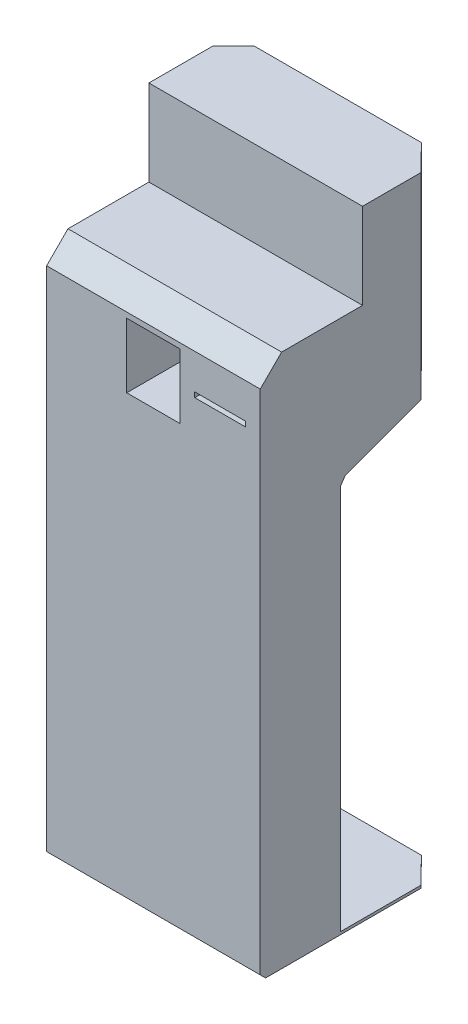
ISO-10303-21;
HEADER;
FILE_DESCRIPTION(('STEP AP214'),'2;1');
FILE_NAME('part.step','',(''),(''),'','','');
FILE_SCHEMA(('AUTOMOTIVE_DESIGN { 1 0 10303 214 1 1 1 1 }'));
ENDSEC;
DATA;
#1=APPLICATION_CONTEXT('core data for automotive mechanical design processes');
#2=APPLICATION_PROTOCOL_DEFINITION('international standard','automotive_design',2000,#1);
#3=PRODUCT_CONTEXT('',#1,'mechanical');
#4=PRODUCT('Part','Part','',(#3));
#5=PRODUCT_RELATED_PRODUCT_CATEGORY('part','',(#4));
#6=PRODUCT_DEFINITION_FORMATION('','',#4);
#7=PRODUCT_DEFINITION_CONTEXT('part definition',#1,'design');
#8=PRODUCT_DEFINITION('design','',#6,#7);
#9=PRODUCT_DEFINITION_SHAPE('','',#8);
#10=(LENGTH_UNIT() NAMED_UNIT(*) SI_UNIT(.MILLI.,.METRE.));
#11=(NAMED_UNIT(*) PLANE_ANGLE_UNIT() SI_UNIT($,.RADIAN.));
#12=(NAMED_UNIT(*) SI_UNIT($,.STERADIAN.) SOLID_ANGLE_UNIT());
#13=UNCERTAINTY_MEASURE_WITH_UNIT(LENGTH_MEASURE(1.E-05),#10,'distance_accuracy_value','');
#14=(GEOMETRIC_REPRESENTATION_CONTEXT(3) GLOBAL_UNCERTAINTY_ASSIGNED_CONTEXT((#13)) GLOBAL_UNIT_ASSIGNED_CONTEXT((#10,
#11,#12)) REPRESENTATION_CONTEXT('',''));
#15=CARTESIAN_POINT('',(0.,0.,0.));
#16=DIRECTION('',(0.,0.,1.));
#17=DIRECTION('',(1.,0.,0.));
#18=AXIS2_PLACEMENT_3D('',#15,#16,#17);
#19=CARTESIAN_POINT('',(400.,5.,0.));
#20=DIRECTION('',(0.,0.,1.));
#21=DIRECTION('',(0.,-1.,0.));
#22=AXIS2_PLACEMENT_3D('',#19,#20,#21);
#23=PLANE('',#22);
#24=DIRECTION('',(-1.,0.,0.));
#25=VECTOR('',#24,1.);
#26=CARTESIAN_POINT('',(400.,0.,0.));
#27=LINE('',#26,#25);
#28=CARTESIAN_POINT('',(351.734705208214,0.,0.));
#29=VERTEX_POINT('',#28);
#30=CARTESIAN_POINT('',(38.6420778551322,0.,0.));
#31=VERTEX_POINT('',#30);
#32=EDGE_CURVE('E283',#29,#31,#27,.T.);
#33=ORIENTED_EDGE('',*,*,#32,.T.);
#34=DIRECTION('',(0.,1.,0.));
#35=VECTOR('',#34,1.);
#36=CARTESIAN_POINT('',(38.6420778551322,5.00000000000004,0.));
#37=LINE('',#36,#35);
#38=CARTESIAN_POINT('',(38.6420778551322,5.,0.));
#39=VERTEX_POINT('',#38);
#40=EDGE_CURVE('E369',#31,#39,#37,.T.);
#41=ORIENTED_EDGE('',*,*,#40,.T.);
#42=DIRECTION('',(-1.,0.,0.));
#43=VECTOR('',#42,1.);
#44=CARTESIAN_POINT('',(400.,5.,0.));
#45=LINE('',#44,#43);
#46=CARTESIAN_POINT('',(351.734705208214,5.,0.));
#47=VERTEX_POINT('',#46);
#48=EDGE_CURVE('E250',#47,#39,#45,.T.);
#49=ORIENTED_EDGE('',*,*,#48,.F.);
#50=DIRECTION('',(0.,-1.,0.));
#51=VECTOR('',#50,1.);
#52=CARTESIAN_POINT('',(351.734705208214,4.99999999999999,0.));
#53=LINE('',#52,#51);
#54=EDGE_CURVE('E370',#47,#29,#53,.T.);
#55=ORIENTED_EDGE('',*,*,#54,.T.);
#56=EDGE_LOOP('',(#33,#41,#49,#55));
#57=FACE_BOUND('',#56,.T.);
#58=ADVANCED_FACE('F35',(#57),#23,.F.);
#59=CARTESIAN_POINT('',(400.,5.,200.));
#60=DIRECTION('',(0.,-1.,0.));
#61=DIRECTION('',(0.,0.,-1.));
#62=AXIS2_PLACEMENT_3D('',#59,#60,#61);
#63=PLANE('',#62);
#64=ORIENTED_EDGE('',*,*,#48,.T.);
#65=DIRECTION('',(-0.701254440401762,0.,0.712911081283502));
#66=VECTOR('',#65,1.);
#67=CARTESIAN_POINT('',(116.356238841946,5.,-79.0059689438939));
#68=LINE('',#67,#66);
#69=CARTESIAN_POINT('',(0.,5.,39.284407940377));
#70=VERTEX_POINT('',#69);
#71=EDGE_CURVE('E378',#39,#70,#68,.T.);
#72=ORIENTED_EDGE('',*,*,#71,.T.);
#73=DIRECTION('',(0.,0.,1.));
#74=VECTOR('',#73,1.);
#75=CARTESIAN_POINT('',(0.,5.,200.));
#76=LINE('',#75,#74);
#77=CARTESIAN_POINT('',(0.,5.,200.));
#78=VERTEX_POINT('',#77);
#79=EDGE_CURVE('E284',#70,#78,#76,.T.);
#80=ORIENTED_EDGE('',*,*,#79,.T.);
#81=DIRECTION('',(-1.,0.,0.));
#82=VECTOR('',#81,1.);
#83=CARTESIAN_POINT('',(400.,5.,200.));
#84=LINE('',#83,#82);
#85=CARTESIAN_POINT('',(400.,5.,200.));
#86=VERTEX_POINT('',#85);
#87=EDGE_CURVE('E247',#86,#78,#84,.T.);
#88=ORIENTED_EDGE('',*,*,#87,.F.);
#89=DIRECTION('',(0.,0.,1.));
#90=VECTOR('',#89,1.);
#91=CARTESIAN_POINT('',(400.,5.,200.));
#92=LINE('',#91,#90);
#93=CARTESIAN_POINT('',(400.,5.,49.0675873350135));
#94=VERTEX_POINT('',#93);
#95=EDGE_CURVE('E310',#94,#86,#92,.T.);
#96=ORIENTED_EDGE('',*,*,#95,.F.);
#97=DIRECTION('',(-0.701254440401762,0.,-0.712911081283502));
#98=VECTOR('',#97,1.);
#99=CARTESIAN_POINT('',(475.455952189898,5.,125.777810280849));
#100=LINE('',#99,#98);
#101=EDGE_CURVE('E57',#94,#47,#100,.T.);
#102=ORIENTED_EDGE('',*,*,#101,.T.);
#103=EDGE_LOOP('',(#64,#72,#80,#88,#96,#102));
#104=FACE_BOUND('',#103,.T.);
#105=ADVANCED_FACE('F358',(#104),#63,.F.);
#106=CARTESIAN_POINT('',(400.,727.20595314676,200.));
#107=DIRECTION('',(0.,0.,1.));
#108=DIRECTION('',(0.,-1.,0.));
#109=AXIS2_PLACEMENT_3D('',#106,#107,#108);
#110=PLANE('',#109);
#111=DIRECTION('',(0.,1.,0.));
#112=VECTOR('',#111,1.);
#113=CARTESIAN_POINT('',(0.,727.20595314676,200.));
#114=LINE('',#113,#112);
#115=CARTESIAN_POINT('',(0.,727.20595314676,200.));
#116=VERTEX_POINT('',#115);
#117=EDGE_CURVE('E286',#78,#116,#114,.T.);
#118=ORIENTED_EDGE('',*,*,#117,.T.);
#119=DIRECTION('',(-1.,0.,0.));
#120=VECTOR('',#119,1.);
#121=CARTESIAN_POINT('',(400.,727.20595314676,200.));
#122=LINE('',#121,#120);
#123=CARTESIAN_POINT('',(400.,727.20595314676,200.));
#124=VERTEX_POINT('',#123);
#125=EDGE_CURVE('E244',#124,#116,#122,.T.);
#126=ORIENTED_EDGE('',*,*,#125,.F.);
#127=DIRECTION('',(0.,1.,0.));
#128=VECTOR('',#127,1.);
#129=CARTESIAN_POINT('',(400.,727.20595314676,200.));
#130=LINE('',#129,#128);
#131=EDGE_CURVE('E458',#86,#124,#130,.T.);
#132=ORIENTED_EDGE('',*,*,#131,.F.);
#133=ORIENTED_EDGE('',*,*,#87,.T.);
#134=EDGE_LOOP('',(#118,#126,#132,#133));
#135=FACE_BOUND('',#134,.T.);
#136=ADVANCED_FACE('F363',(#135),#110,.F.);
#137=CARTESIAN_POINT('',(400.,740.626154580017,190.603073792141));
#138=DIRECTION('',(0.,0.573576436351043,0.819152044288994));
#139=DIRECTION('',(0.,-0.819152044288994,0.573576436351043));
#140=AXIS2_PLACEMENT_3D('',#137,#138,#139);
#141=PLANE('',#140);
#142=DIRECTION('',(0.,0.819152044288994,-0.573576436351043));
#143=VECTOR('',#142,1.);
#144=CARTESIAN_POINT('',(0.,740.626154580017,190.603073792141));
#145=LINE('',#144,#143);
#146=CARTESIAN_POINT('',(0.,740.626154580017,190.603073792141));
#147=VERTEX_POINT('',#146);
#148=EDGE_CURVE('E289',#116,#147,#145,.T.);
#149=ORIENTED_EDGE('',*,*,#148,.T.);
#150=DIRECTION('',(-1.,0.,0.));
#151=VECTOR('',#150,1.);
#152=CARTESIAN_POINT('',(400.,740.626154580017,190.603073792141));
#153=LINE('',#152,#151);
#154=CARTESIAN_POINT('',(400.,740.626154580017,190.603073792141));
#155=VERTEX_POINT('',#154);
#156=EDGE_CURVE('E241',#155,#147,#153,.T.);
#157=ORIENTED_EDGE('',*,*,#156,.F.);
#158=DIRECTION('',(0.,0.819152044288994,-0.573576436351043));
#159=VECTOR('',#158,1.);
#160=CARTESIAN_POINT('',(400.,740.626154580017,190.603073792141));
#161=LINE('',#160,#159);
#162=EDGE_CURVE('E270',#124,#155,#161,.T.);
#163=ORIENTED_EDGE('',*,*,#162,.F.);
#164=ORIENTED_EDGE('',*,*,#125,.T.);
#165=EDGE_LOOP('',(#149,#157,#163,#164));
#166=FACE_BOUND('',#165,.T.);
#167=ADVANCED_FACE('F464',(#166),#141,.F.);
#168=CARTESIAN_POINT('',(400.,806.579798566743,9.39692620785923));
#169=DIRECTION('',(0.,0.939692620785909,0.342020143325666));
#170=DIRECTION('',(0.,-0.342020143325666,0.93969262078591));
#171=AXIS2_PLACEMENT_3D('',#168,#169,#170);
#172=PLANE('',#171);
#173=DIRECTION('',(0.,0.342020143325666,-0.939692620785909));
#174=VECTOR('',#173,1.);
#175=CARTESIAN_POINT('',(0.,806.579798566743,9.39692620785923));
#176=LINE('',#175,#174);
#177=CARTESIAN_POINT('',(0.,795.701644838932,39.284407940377));
#178=VERTEX_POINT('',#177);
#179=EDGE_CURVE('E292',#147,#178,#176,.T.);
#180=ORIENTED_EDGE('',*,*,#179,.T.);
#181=DIRECTION('',(0.678775971324877,0.251160922277189,-0.69005896260598));
#182=VECTOR('',#181,1.);
#183=CARTESIAN_POINT('',(200.148417326644,869.760632209921,-164.190987569091));
#184=LINE('',#183,#182);
#185=CARTESIAN_POINT('',(29.3987985705331,806.579798566743,9.39692620785923));
#186=VERTEX_POINT('',#185);
#187=EDGE_CURVE('E215',#178,#186,#184,.T.);
#188=ORIENTED_EDGE('',*,*,#187,.T.);
#189=DIRECTION('',(-1.,0.,0.));
#190=VECTOR('',#189,1.);
#191=CARTESIAN_POINT('',(400.,806.579798566743,9.39692620785923));
#192=LINE('',#191,#190);
#193=CARTESIAN_POINT('',(360.977984492813,806.579798566743,9.39692620785923));
#194=VERTEX_POINT('',#193);
#195=EDGE_CURVE('E232',#194,#186,#192,.T.);
#196=ORIENTED_EDGE('',*,*,#195,.F.);
#197=DIRECTION('',(0.678775971324877,-0.251160922277189,0.69005896260598));
#198=VECTOR('',#197,1.);
#199=CARTESIAN_POINT('',(378.956863798241,799.927247358945,27.6746604330507));
#200=LINE('',#199,#198);
#201=CARTESIAN_POINT('',(400.,792.140858742798,49.0675873350135));
#202=VERTEX_POINT('',#201);
#203=EDGE_CURVE('E384',#194,#202,#200,.T.);
#204=ORIENTED_EDGE('',*,*,#203,.T.);
#205=DIRECTION('',(0.,0.342020143325666,-0.939692620785909));
#206=VECTOR('',#205,1.);
#207=CARTESIAN_POINT('',(400.,800.,27.4747741945468));
#208=LINE('',#207,#206);
#209=EDGE_CURVE('E263',#155,#202,#208,.T.);
#210=ORIENTED_EDGE('',*,*,#209,.F.);
#211=ORIENTED_EDGE('',*,*,#156,.T.);
#212=EDGE_LOOP('',(#180,#188,#196,#204,#210,#211));
#213=FACE_BOUND('',#212,.T.);
#214=ADVANCED_FACE('F467',(#213),#172,.F.);
#215=CARTESIAN_POINT('',(400.,820.,0.));
#216=DIRECTION('',(0.,0.57357643635105,0.819152044288989));
#217=DIRECTION('',(0.,-0.819152044288989,0.57357643635105));
#218=AXIS2_PLACEMENT_3D('',#215,#216,#217);
#219=PLANE('',#218);
#220=ORIENTED_EDGE('',*,*,#195,.T.);
#221=DIRECTION('',(0.491384255613947,0.713434646777101,-0.499552317693313));
#222=VECTOR('',#221,1.);
#223=CARTESIAN_POINT('',(125.895014880739,946.68144653791,-88.7033038171555));
#224=LINE('',#223,#222);
#225=CARTESIAN_POINT('',(38.6420778551321,820.,1.2490009027033E-13));
#226=VERTEX_POINT('',#225);
#227=EDGE_CURVE('E226',#186,#226,#224,.T.);
#228=ORIENTED_EDGE('',*,*,#227,.T.);
#229=DIRECTION('',(-1.,0.,0.));
#230=VECTOR('',#229,1.);
#231=CARTESIAN_POINT('',(400.,820.,0.));
#232=LINE('',#231,#230);
#233=CARTESIAN_POINT('',(351.734705208214,820.,0.));
#234=VERTEX_POINT('',#233);
#235=EDGE_CURVE('E224',#234,#226,#232,.T.);
#236=ORIENTED_EDGE('',*,*,#235,.F.);
#237=DIRECTION('',(0.491384255613947,-0.713434646777101,0.499552317693313));
#238=VECTOR('',#237,1.);
#239=CARTESIAN_POINT('',(363.388770247092,803.079608922062,11.8477853822285));
#240=LINE('',#239,#238);
#241=EDGE_CURVE('E386',#234,#194,#240,.T.);
#242=ORIENTED_EDGE('',*,*,#241,.T.);
#243=EDGE_LOOP('',(#220,#228,#236,#242));
#244=FACE_BOUND('',#243,.T.);
#245=ADVANCED_FACE('F472',(#244),#219,.F.);
#246=CARTESIAN_POINT('',(400.,1000.,0.));
#247=DIRECTION('',(0.,0.,1.));
#248=DIRECTION('',(1.,0.,0.));
#249=AXIS2_PLACEMENT_3D('',#246,#247,#248);
#250=PLANE('',#249);
#251=ORIENTED_EDGE('',*,*,#235,.T.);
#252=DIRECTION('',(0.,1.,0.));
#253=VECTOR('',#252,1.);
#254=CARTESIAN_POINT('',(38.6420778551322,1000.,0.));
#255=LINE('',#254,#253);
#256=CARTESIAN_POINT('',(38.6420778551323,1160.69690242163,0.));
#257=VERTEX_POINT('',#256);
#258=EDGE_CURVE('E208',#226,#257,#255,.T.);
#259=ORIENTED_EDGE('',*,*,#258,.T.);
#260=DIRECTION('',(-1.,0.,0.));
#261=VECTOR('',#260,1.);
#262=CARTESIAN_POINT('',(400.,1160.69690242163,0.));
#263=LINE('',#262,#261);
#264=CARTESIAN_POINT('',(351.734705208214,1160.69690242163,0.));
#265=VERTEX_POINT('',#264);
#266=EDGE_CURVE('E222',#265,#257,#263,.T.);
#267=ORIENTED_EDGE('',*,*,#266,.F.);
#268=DIRECTION('',(0.,-1.,0.));
#269=VECTOR('',#268,1.);
#270=CARTESIAN_POINT('',(351.734705208214,1000.,0.));
#271=LINE('',#270,#269);
#272=EDGE_CURVE('E389',#265,#234,#271,.T.);
#273=ORIENTED_EDGE('',*,*,#272,.T.);
#274=EDGE_LOOP('',(#251,#259,#267,#273));
#275=FACE_BOUND('',#274,.T.);
#276=ADVANCED_FACE('F220',(#275),#250,.F.);
#277=CARTESIAN_POINT('',(400.,1160.69690242163,158.488889220255));
#278=DIRECTION('',(0.,-1.,0.));
#279=DIRECTION('',(0.,0.,-1.));
#280=AXIS2_PLACEMENT_3D('',#277,#278,#279);
#281=PLANE('',#280);
#282=ORIENTED_EDGE('',*,*,#266,.T.);
#283=DIRECTION('',(-0.701254440401762,0.,0.712911081283502));
#284=VECTOR('',#283,1.);
#285=CARTESIAN_POINT('',(-32.9719100035619,1160.69690242163,72.804395349162));
#286=LINE('',#285,#284);
#287=CARTESIAN_POINT('',(0.,1160.69690242163,39.284407940377));
#288=VERTEX_POINT('',#287);
#289=EDGE_CURVE('E205',#257,#288,#286,.T.);
#290=ORIENTED_EDGE('',*,*,#289,.T.);
#291=DIRECTION('',(0.,0.,1.));
#292=VECTOR('',#291,1.);
#293=CARTESIAN_POINT('',(0.,1160.69690242163,158.488889220255));
#294=LINE('',#293,#292);
#295=CARTESIAN_POINT('',(0.,1160.69690242163,158.488889220255));
#296=VERTEX_POINT('',#295);
#297=EDGE_CURVE('E295',#288,#296,#294,.T.);
#298=ORIENTED_EDGE('',*,*,#297,.T.);
#299=DIRECTION('',(-1.,0.,0.));
#300=VECTOR('',#299,1.);
#301=CARTESIAN_POINT('',(400.,1160.69690242163,158.488889220255));
#302=LINE('',#301,#300);
#303=CARTESIAN_POINT('',(400.,1160.69690242163,158.488889220255));
#304=VERTEX_POINT('',#303);
#305=EDGE_CURVE('E230',#304,#296,#302,.T.);
#306=ORIENTED_EDGE('',*,*,#305,.F.);
#307=DIRECTION('',(0.,0.,1.));
#308=VECTOR('',#307,1.);
#309=CARTESIAN_POINT('',(400.,1160.69690242163,0.));
#310=LINE('',#309,#308);
#311=CARTESIAN_POINT('',(400.,1160.69690242163,49.0675873350135));
#312=VERTEX_POINT('',#311);
#313=EDGE_CURVE('E260',#312,#304,#310,.T.);
#314=ORIENTED_EDGE('',*,*,#313,.F.);
#315=DIRECTION('',(-0.701254440401762,0.,-0.712911081283502));
#316=VECTOR('',#315,1.);
#317=CARTESIAN_POINT('',(322.648629758769,1160.69690242163,-29.5695603539813));
#318=LINE('',#317,#316);
#319=EDGE_CURVE('E49',#312,#265,#318,.T.);
#320=ORIENTED_EDGE('',*,*,#319,.T.);
#321=EDGE_LOOP('',(#282,#290,#298,#306,#314,#320));
#322=FACE_BOUND('',#321,.T.);
#323=ADVANCED_FACE('F228',(#322),#281,.F.);
#324=CARTESIAN_POINT('',(400.,1000.,158.488889220255));
#325=DIRECTION('',(0.,0.,-1.));
#326=DIRECTION('',(-1.,0.,0.));
#327=AXIS2_PLACEMENT_3D('',#324,#325,#326);
#328=PLANE('',#327);
#329=DIRECTION('',(0.,-1.,0.));
#330=VECTOR('',#329,1.);
#331=CARTESIAN_POINT('',(0.,1000.,158.488889220255));
#332=LINE('',#331,#330);
#333=CARTESIAN_POINT('',(0.,1000.,158.488889220255));
#334=VERTEX_POINT('',#333);
#335=EDGE_CURVE('E297',#296,#334,#332,.T.);
#336=ORIENTED_EDGE('',*,*,#335,.T.);
#337=DIRECTION('',(-1.,0.,0.));
#338=VECTOR('',#337,1.);
#339=CARTESIAN_POINT('',(400.,1000.,158.488889220255));
#340=LINE('',#339,#338);
#341=CARTESIAN_POINT('',(400.,1000.,158.488889220255));
#342=VERTEX_POINT('',#341);
#343=EDGE_CURVE('E235',#342,#334,#340,.T.);
#344=ORIENTED_EDGE('',*,*,#343,.F.);
#345=DIRECTION('',(0.,-1.,0.));
#346=VECTOR('',#345,1.);
#347=CARTESIAN_POINT('',(400.,1000.,158.488889220255));
#348=LINE('',#347,#346);
#349=EDGE_CURVE('E266',#304,#342,#348,.T.);
#350=ORIENTED_EDGE('',*,*,#349,.F.);
#351=ORIENTED_EDGE('',*,*,#305,.T.);
#352=EDGE_LOOP('',(#336,#344,#350,#351));
#353=FACE_BOUND('',#352,.T.);
#354=ADVANCED_FACE('F348',(#353),#328,.F.);
#355=CARTESIAN_POINT('',(400.,1000.,310.));
#356=DIRECTION('',(0.,-1.,0.));
#357=DIRECTION('',(0.,0.,-1.));
#358=AXIS2_PLACEMENT_3D('',#355,#356,#357);
#359=PLANE('',#358);
#360=DIRECTION('',(0.,0.,1.));
#361=VECTOR('',#360,1.);
#362=CARTESIAN_POINT('',(0.,1000.,310.));
#363=LINE('',#362,#361);
#364=CARTESIAN_POINT('',(0.,1000.,310.));
#365=VERTEX_POINT('',#364);
#366=EDGE_CURVE('E299',#334,#365,#363,.T.);
#367=ORIENTED_EDGE('',*,*,#366,.T.);
#368=DIRECTION('',(-1.,0.,0.));
#369=VECTOR('',#368,1.);
#370=CARTESIAN_POINT('',(400.,1000.,310.));
#371=LINE('',#370,#369);
#372=CARTESIAN_POINT('',(400.,1000.,310.));
#373=VERTEX_POINT('',#372);
#374=EDGE_CURVE('E322',#373,#365,#371,.T.);
#375=ORIENTED_EDGE('',*,*,#374,.F.);
#376=DIRECTION('',(0.,0.,1.));
#377=VECTOR('',#376,1.);
#378=CARTESIAN_POINT('',(400.,1000.,310.));
#379=LINE('',#378,#377);
#380=EDGE_CURVE('E268',#342,#373,#379,.T.);
#381=ORIENTED_EDGE('',*,*,#380,.F.);
#382=ORIENTED_EDGE('',*,*,#343,.T.);
#383=EDGE_LOOP('',(#367,#375,#381,#382));
#384=FACE_BOUND('',#383,.T.);
#385=ADVANCED_FACE('F329',(#384),#359,.F.);
#386=CARTESIAN_POINT('',(400.,1000.,310.));
#387=DIRECTION('',(0.,-0.707106781186547,-0.707106781186547));
#388=DIRECTION('',(0.,0.707106781186548,-0.707106781186548));
#389=AXIS2_PLACEMENT_3D('',#386,#387,#388);
#390=PLANE('',#389);
#391=DIRECTION('',(0.,-0.707106781186547,0.707106781186547));
#392=VECTOR('',#391,1.);
#393=CARTESIAN_POINT('',(0.,1000.,310.));
#394=LINE('',#393,#392);
#395=CARTESIAN_POINT('',(0.,960.,350.));
#396=VERTEX_POINT('',#395);
#397=EDGE_CURVE('E301',#365,#396,#394,.T.);
#398=ORIENTED_EDGE('',*,*,#397,.T.);
#399=DIRECTION('',(-1.,0.,0.));
#400=VECTOR('',#399,1.);
#401=CARTESIAN_POINT('',(400.,960.,350.));
#402=LINE('',#401,#400);
#403=CARTESIAN_POINT('',(400.,960.,350.));
#404=VERTEX_POINT('',#403);
#405=EDGE_CURVE('E319',#404,#396,#402,.T.);
#406=ORIENTED_EDGE('',*,*,#405,.F.);
#407=DIRECTION('',(0.,-0.707106781186547,0.707106781186547));
#408=VECTOR('',#407,1.);
#409=CARTESIAN_POINT('',(400.,1000.,310.));
#410=LINE('',#409,#408);
#411=EDGE_CURVE('E275',#373,#404,#410,.T.);
#412=ORIENTED_EDGE('',*,*,#411,.F.);
#413=ORIENTED_EDGE('',*,*,#374,.T.);
#414=EDGE_LOOP('',(#398,#406,#412,#413));
#415=FACE_BOUND('',#414,.T.);
#416=ADVANCED_FACE('F340',(#415),#390,.F.);
#417=CARTESIAN_POINT('',(400.,9.99999999999996,350.));
#418=DIRECTION('',(0.,0.,-1.));
#419=DIRECTION('',(0.,1.,0.));
#420=AXIS2_PLACEMENT_3D('',#417,#418,#419);
#421=PLANE('',#420);
#422=DIRECTION('',(-1.,0.,0.));
#423=VECTOR('',#422,1.);
#424=CARTESIAN_POINT('',(372.65,894.2,350.));
#425=LINE('',#424,#423);
#426=CARTESIAN_POINT('',(372.65,894.2,350.));
#427=VERTEX_POINT('',#426);
#428=CARTESIAN_POINT('',(277.35,894.2,350.));
#429=VERTEX_POINT('',#428);
#430=EDGE_CURVE('E410',#427,#429,#425,.T.);
#431=ORIENTED_EDGE('',*,*,#430,.F.);
#432=DIRECTION('',(0.,1.,0.));
#433=VECTOR('',#432,1.);
#434=CARTESIAN_POINT('',(372.65,894.2,350.));
#435=LINE('',#434,#433);
#436=CARTESIAN_POINT('',(372.65,884.8,350.));
#437=VERTEX_POINT('',#436);
#438=EDGE_CURVE('E394',#437,#427,#435,.T.);
#439=ORIENTED_EDGE('',*,*,#438,.F.);
#440=DIRECTION('',(1.,0.,0.));
#441=VECTOR('',#440,1.);
#442=CARTESIAN_POINT('',(372.65,884.8,350.));
#443=LINE('',#442,#441);
#444=CARTESIAN_POINT('',(277.35,884.8,350.));
#445=VERTEX_POINT('',#444);
#446=EDGE_CURVE('E399',#445,#437,#443,.T.);
#447=ORIENTED_EDGE('',*,*,#446,.F.);
#448=DIRECTION('',(0.,-1.,0.));
#449=VECTOR('',#448,1.);
#450=CARTESIAN_POINT('',(277.35,894.2,350.));
#451=LINE('',#450,#449);
#452=EDGE_CURVE('E413',#429,#445,#451,.T.);
#453=ORIENTED_EDGE('',*,*,#452,.F.);
#454=EDGE_LOOP('',(#431,#439,#447,#453));
#455=FACE_BOUND('',#454,.T.);
#456=DIRECTION('',(1.,0.,0.));
#457=VECTOR('',#456,1.);
#458=CARTESIAN_POINT('',(150.,829.,350.));
#459=LINE('',#458,#457);
#460=CARTESIAN_POINT('',(150.,829.,350.));
#461=VERTEX_POINT('',#460);
#462=CARTESIAN_POINT('',(250.,829.,350.));
#463=VERTEX_POINT('',#462);
#464=EDGE_CURVE('E442',#461,#463,#459,.T.);
#465=ORIENTED_EDGE('',*,*,#464,.F.);
#466=DIRECTION('',(0.,-1.,0.));
#467=VECTOR('',#466,1.);
#468=CARTESIAN_POINT('',(150.,950.,350.));
#469=LINE('',#468,#467);
#470=CARTESIAN_POINT('',(150.,950.,350.));
#471=VERTEX_POINT('',#470);
#472=EDGE_CURVE('E420',#471,#461,#469,.T.);
#473=ORIENTED_EDGE('',*,*,#472,.F.);
#474=DIRECTION('',(-1.,0.,0.));
#475=VECTOR('',#474,1.);
#476=CARTESIAN_POINT('',(150.,950.,350.));
#477=LINE('',#476,#475);
#478=CARTESIAN_POINT('',(250.,950.,350.));
#479=VERTEX_POINT('',#478);
#480=EDGE_CURVE('E431',#479,#471,#477,.T.);
#481=ORIENTED_EDGE('',*,*,#480,.F.);
#482=DIRECTION('',(0.,1.,0.));
#483=VECTOR('',#482,1.);
#484=CARTESIAN_POINT('',(250.,950.,350.));
#485=LINE('',#484,#483);
#486=EDGE_CURVE('E445',#463,#479,#485,.T.);
#487=ORIENTED_EDGE('',*,*,#486,.F.);
#488=EDGE_LOOP('',(#465,#473,#481,#487));
#489=FACE_BOUND('',#488,.T.);
#490=DIRECTION('',(0.,-1.,0.));
#491=VECTOR('',#490,1.);
#492=CARTESIAN_POINT('',(0.,9.99999999999996,350.));
#493=LINE('',#492,#491);
#494=CARTESIAN_POINT('',(0.,9.99999999999996,350.));
#495=VERTEX_POINT('',#494);
#496=EDGE_CURVE('E303',#396,#495,#493,.T.);
#497=ORIENTED_EDGE('',*,*,#496,.T.);
#498=DIRECTION('',(-1.,0.,0.));
#499=VECTOR('',#498,1.);
#500=CARTESIAN_POINT('',(400.,9.99999999999996,350.));
#501=LINE('',#500,#499);
#502=CARTESIAN_POINT('',(400.,9.99999999999996,350.));
#503=VERTEX_POINT('',#502);
#504=EDGE_CURVE('E316',#503,#495,#501,.T.);
#505=ORIENTED_EDGE('',*,*,#504,.F.);
#506=DIRECTION('',(0.,-1.,0.));
#507=VECTOR('',#506,1.);
#508=CARTESIAN_POINT('',(400.,9.99999999999996,350.));
#509=LINE('',#508,#507);
#510=EDGE_CURVE('E277',#404,#503,#509,.T.);
#511=ORIENTED_EDGE('',*,*,#510,.F.);
#512=ORIENTED_EDGE('',*,*,#405,.T.);
#513=EDGE_LOOP('',(#497,#505,#511,#512));
#514=FACE_BOUND('',#513,.T.);
#515=ADVANCED_FACE('F344',(#455,#489,#514),#421,.F.);
#516=CARTESIAN_POINT('',(400.,0.,340.));
#517=DIRECTION('',(0.,0.707106781186548,-0.707106781186547));
#518=DIRECTION('',(0.,0.707106781186547,0.707106781186548));
#519=AXIS2_PLACEMENT_3D('',#516,#517,#518);
#520=PLANE('',#519);
#521=DIRECTION('',(0.,-0.707106781186547,-0.707106781186548));
#522=VECTOR('',#521,1.);
#523=CARTESIAN_POINT('',(0.,0.,340.));
#524=LINE('',#523,#522);
#525=CARTESIAN_POINT('',(0.,0.,340.));
#526=VERTEX_POINT('',#525);
#527=EDGE_CURVE('E305',#495,#526,#524,.T.);
#528=ORIENTED_EDGE('',*,*,#527,.T.);
#529=DIRECTION('',(-1.,0.,0.));
#530=VECTOR('',#529,1.);
#531=CARTESIAN_POINT('',(400.,0.,340.));
#532=LINE('',#531,#530);
#533=CARTESIAN_POINT('',(400.,0.,340.));
#534=VERTEX_POINT('',#533);
#535=EDGE_CURVE('E313',#534,#526,#532,.T.);
#536=ORIENTED_EDGE('',*,*,#535,.F.);
#537=DIRECTION('',(0.,-0.707106781186547,-0.707106781186548));
#538=VECTOR('',#537,1.);
#539=CARTESIAN_POINT('',(400.,0.,340.));
#540=LINE('',#539,#538);
#541=EDGE_CURVE('E279',#503,#534,#540,.T.);
#542=ORIENTED_EDGE('',*,*,#541,.F.);
#543=ORIENTED_EDGE('',*,*,#504,.T.);
#544=EDGE_LOOP('',(#528,#536,#542,#543));
#545=FACE_BOUND('',#544,.T.);
#546=ADVANCED_FACE('F537',(#545),#520,.F.);
#547=CARTESIAN_POINT('',(400.,0.,0.));
#548=DIRECTION('',(0.,1.,0.));
#549=DIRECTION('',(0.,0.,1.));
#550=AXIS2_PLACEMENT_3D('',#547,#548,#549);
#551=PLANE('',#550);
#552=DIRECTION('',(0.,0.,-1.));
#553=VECTOR('',#552,1.);
#554=CARTESIAN_POINT('',(0.,0.,0.));
#555=LINE('',#554,#553);
#556=CARTESIAN_POINT('',(0.,0.,39.284407940377));
#557=VERTEX_POINT('',#556);
#558=EDGE_CURVE('E307',#526,#557,#555,.T.);
#559=ORIENTED_EDGE('',*,*,#558,.T.);
#560=DIRECTION('',(0.701254440401762,0.,-0.712911081283502));
#561=VECTOR('',#560,1.);
#562=CARTESIAN_POINT('',(216.342651114281,0.,-180.654410907256));
#563=LINE('',#562,#561);
#564=EDGE_CURVE('E225',#557,#31,#563,.T.);
#565=ORIENTED_EDGE('',*,*,#564,.T.);
#566=ORIENTED_EDGE('',*,*,#32,.F.);
#567=DIRECTION('',(0.701254440401762,0.,0.712911081283502));
#568=VECTOR('',#567,1.);
#569=CARTESIAN_POINT('',(375.469539917563,0.,24.1293683174868));
#570=LINE('',#569,#568);
#571=CARTESIAN_POINT('',(400.,0.,49.0675873350135));
#572=VERTEX_POINT('',#571);
#573=EDGE_CURVE('E376',#29,#572,#570,.T.);
#574=ORIENTED_EDGE('',*,*,#573,.T.);
#575=DIRECTION('',(0.,0.,-1.));
#576=VECTOR('',#575,1.);
#577=CARTESIAN_POINT('',(400.,0.,0.));
#578=LINE('',#577,#576);
#579=EDGE_CURVE('E281',#534,#572,#578,.T.);
#580=ORIENTED_EDGE('',*,*,#579,.F.);
#581=ORIENTED_EDGE('',*,*,#535,.T.);
#582=EDGE_LOOP('',(#559,#565,#566,#574,#580,#581));
#583=FACE_BOUND('',#582,.T.);
#584=ADVANCED_FACE('F374',(#583),#551,.F.);
#585=CARTESIAN_POINT('',(400.,0.,0.));
#586=DIRECTION('',(-1.,0.,0.));
#587=DIRECTION('',(0.,0.,1.));
#588=AXIS2_PLACEMENT_3D('',#585,#586,#587);
#589=PLANE('',#588);
#590=ORIENTED_EDGE('',*,*,#579,.T.);
#591=DIRECTION('',(0.,1.,0.));
#592=VECTOR('',#591,1.);
#593=CARTESIAN_POINT('',(400.,0.,49.0675873350135));
#594=LINE('',#593,#592);
#595=EDGE_CURVE('E11',#572,#94,#594,.T.);
#596=ORIENTED_EDGE('',*,*,#595,.T.);
#597=ORIENTED_EDGE('',*,*,#95,.T.);
#598=ORIENTED_EDGE('',*,*,#131,.T.);
#599=ORIENTED_EDGE('',*,*,#162,.T.);
#600=ORIENTED_EDGE('',*,*,#209,.T.);
#601=EDGE_CURVE('E38',#202,#312,#594,.T.);
#602=ORIENTED_EDGE('',*,*,#601,.T.);
#603=ORIENTED_EDGE('',*,*,#313,.T.);
#604=ORIENTED_EDGE('',*,*,#349,.T.);
#605=ORIENTED_EDGE('',*,*,#380,.T.);
#606=ORIENTED_EDGE('',*,*,#411,.T.);
#607=ORIENTED_EDGE('',*,*,#510,.T.);
#608=ORIENTED_EDGE('',*,*,#541,.T.);
#609=EDGE_LOOP('',(#590,#596,#597,#598,#599,#600,#602,#603,#604,#605,#606,#607,#608));
#610=FACE_BOUND('',#609,.T.);
#611=ADVANCED_FACE('F259',(#610),#589,.F.);
#612=CARTESIAN_POINT('',(0.,0.,0.));
#613=DIRECTION('',(-1.,0.,0.));
#614=DIRECTION('',(0.,0.,1.));
#615=AXIS2_PLACEMENT_3D('',#612,#613,#614);
#616=PLANE('',#615);
#617=DIRECTION('',(0.,1.,0.));
#618=VECTOR('',#617,1.);
#619=CARTESIAN_POINT('',(0.,0.,39.284407940377));
#620=LINE('',#619,#618);
#621=EDGE_CURVE('E252',#557,#70,#620,.T.);
#622=ORIENTED_EDGE('',*,*,#621,.F.);
#623=ORIENTED_EDGE('',*,*,#558,.F.);
#624=ORIENTED_EDGE('',*,*,#527,.F.);
#625=ORIENTED_EDGE('',*,*,#496,.F.);
#626=ORIENTED_EDGE('',*,*,#397,.F.);
#627=ORIENTED_EDGE('',*,*,#366,.F.);
#628=ORIENTED_EDGE('',*,*,#335,.F.);
#629=ORIENTED_EDGE('',*,*,#297,.F.);
#630=EDGE_CURVE('E211',#178,#288,#620,.T.);
#631=ORIENTED_EDGE('',*,*,#630,.F.);
#632=ORIENTED_EDGE('',*,*,#179,.F.);
#633=ORIENTED_EDGE('',*,*,#148,.F.);
#634=ORIENTED_EDGE('',*,*,#117,.F.);
#635=ORIENTED_EDGE('',*,*,#79,.F.);
#636=EDGE_LOOP('',(#622,#623,#624,#625,#626,#627,#628,#629,#631,#632,#633,#634,#635));
#637=FACE_BOUND('',#636,.T.);
#638=ADVANCED_FACE('F335',(#637),#616,.T.);
#639=CARTESIAN_POINT('',(150.,950.,81.9999999999999));
#640=DIRECTION('',(-1.,0.,0.));
#641=DIRECTION('',(0.,-1.,0.));
#642=AXIS2_PLACEMENT_3D('',#639,#640,#641);
#643=PLANE('',#642);
#644=ORIENTED_EDGE('',*,*,#472,.T.);
#645=DIRECTION('',(0.,0.,1.));
#646=VECTOR('',#645,1.);
#647=CARTESIAN_POINT('',(150.,829.,81.9999999999999));
#648=LINE('',#647,#646);
#649=CARTESIAN_POINT('',(150.,829.,81.9999999999999));
#650=VERTEX_POINT('',#649);
#651=EDGE_CURVE('E440',#650,#461,#648,.T.);
#652=ORIENTED_EDGE('',*,*,#651,.F.);
#653=DIRECTION('',(0.,-1.,0.));
#654=VECTOR('',#653,1.);
#655=CARTESIAN_POINT('',(150.,950.,81.9999999999999));
#656=LINE('',#655,#654);
#657=CARTESIAN_POINT('',(150.,950.,81.9999999999999));
#658=VERTEX_POINT('',#657);
#659=EDGE_CURVE('E427',#658,#650,#656,.T.);
#660=ORIENTED_EDGE('',*,*,#659,.F.);
#661=DIRECTION('',(0.,0.,1.));
#662=VECTOR('',#661,1.);
#663=CARTESIAN_POINT('',(150.,950.,81.9999999999999));
#664=LINE('',#663,#662);
#665=EDGE_CURVE('E287',#658,#471,#664,.T.);
#666=ORIENTED_EDGE('',*,*,#665,.T.);
#667=EDGE_LOOP('',(#644,#652,#660,#666));
#668=FACE_BOUND('',#667,.T.);
#669=ADVANCED_FACE('F520',(#668),#643,.F.);
#670=CARTESIAN_POINT('',(150.,950.,81.9999999999999));
#671=DIRECTION('',(0.,1.,0.));
#672=DIRECTION('',(0.,0.,1.));
#673=AXIS2_PLACEMENT_3D('',#670,#671,#672);
#674=PLANE('',#673);
#675=ORIENTED_EDGE('',*,*,#480,.T.);
#676=ORIENTED_EDGE('',*,*,#665,.F.);
#677=DIRECTION('',(-1.,0.,0.));
#678=VECTOR('',#677,1.);
#679=CARTESIAN_POINT('',(150.,950.,81.9999999999999));
#680=LINE('',#679,#678);
#681=CARTESIAN_POINT('',(250.,950.,81.9999999999999));
#682=VERTEX_POINT('',#681);
#683=EDGE_CURVE('E437',#682,#658,#680,.T.);
#684=ORIENTED_EDGE('',*,*,#683,.F.);
#685=DIRECTION('',(0.,0.,1.));
#686=VECTOR('',#685,1.);
#687=CARTESIAN_POINT('',(250.,950.,81.9999999999999));
#688=LINE('',#687,#686);
#689=EDGE_CURVE('E451',#682,#479,#688,.T.);
#690=ORIENTED_EDGE('',*,*,#689,.T.);
#691=EDGE_LOOP('',(#675,#676,#684,#690));
#692=FACE_BOUND('',#691,.T.);
#693=ADVANCED_FACE('F516',(#692),#674,.F.);
#694=CARTESIAN_POINT('',(250.,950.,81.9999999999999));
#695=DIRECTION('',(1.,0.,0.));
#696=DIRECTION('',(0.,1.,0.));
#697=AXIS2_PLACEMENT_3D('',#694,#695,#696);
#698=PLANE('',#697);
#699=ORIENTED_EDGE('',*,*,#486,.T.);
#700=ORIENTED_EDGE('',*,*,#689,.F.);
#701=DIRECTION('',(0.,1.,0.));
#702=VECTOR('',#701,1.);
#703=CARTESIAN_POINT('',(250.,950.,81.9999999999999));
#704=LINE('',#703,#702);
#705=CARTESIAN_POINT('',(250.,829.,81.9999999999999));
#706=VERTEX_POINT('',#705);
#707=EDGE_CURVE('E434',#706,#682,#704,.T.);
#708=ORIENTED_EDGE('',*,*,#707,.F.);
#709=DIRECTION('',(0.,0.,1.));
#710=VECTOR('',#709,1.);
#711=CARTESIAN_POINT('',(250.,829.,81.9999999999999));
#712=LINE('',#711,#710);
#713=EDGE_CURVE('E453',#706,#463,#712,.T.);
#714=ORIENTED_EDGE('',*,*,#713,.T.);
#715=EDGE_LOOP('',(#699,#700,#708,#714));
#716=FACE_BOUND('',#715,.T.);
#717=ADVANCED_FACE('F519',(#716),#698,.F.);
#718=CARTESIAN_POINT('',(150.,829.,81.9999999999999));
#719=DIRECTION('',(0.,-1.,0.));
#720=DIRECTION('',(0.,0.,-1.));
#721=AXIS2_PLACEMENT_3D('',#718,#719,#720);
#722=PLANE('',#721);
#723=ORIENTED_EDGE('',*,*,#464,.T.);
#724=ORIENTED_EDGE('',*,*,#713,.F.);
#725=DIRECTION('',(1.,0.,0.));
#726=VECTOR('',#725,1.);
#727=CARTESIAN_POINT('',(150.,829.,81.9999999999999));
#728=LINE('',#727,#726);
#729=EDGE_CURVE('E430',#650,#706,#728,.T.);
#730=ORIENTED_EDGE('',*,*,#729,.F.);
#731=ORIENTED_EDGE('',*,*,#651,.T.);
#732=EDGE_LOOP('',(#723,#724,#730,#731));
#733=FACE_BOUND('',#732,.T.);
#734=ADVANCED_FACE('F514',(#733),#722,.F.);
#735=CARTESIAN_POINT('',(0.,0.,81.9999999999999));
#736=DIRECTION('',(0.,0.,1.));
#737=DIRECTION('',(1.,0.,0.));
#738=AXIS2_PLACEMENT_3D('',#735,#736,#737);
#739=PLANE('',#738);
#740=ORIENTED_EDGE('',*,*,#659,.T.);
#741=ORIENTED_EDGE('',*,*,#729,.T.);
#742=ORIENTED_EDGE('',*,*,#707,.T.);
#743=ORIENTED_EDGE('',*,*,#683,.T.);
#744=EDGE_LOOP('',(#740,#741,#742,#743));
#745=FACE_BOUND('',#744,.T.);
#746=ADVANCED_FACE('F510',(#745),#739,.T.);
#747=CARTESIAN_POINT('',(372.65,894.2,81.9999999999999));
#748=DIRECTION('',(1.,0.,0.));
#749=DIRECTION('',(0.,0.,-1.));
#750=AXIS2_PLACEMENT_3D('',#747,#748,#749);
#751=PLANE('',#750);
#752=ORIENTED_EDGE('',*,*,#438,.T.);
#753=DIRECTION('',(0.,0.,1.));
#754=VECTOR('',#753,1.);
#755=CARTESIAN_POINT('',(372.65,894.2,81.9999999999999));
#756=LINE('',#755,#754);
#757=CARTESIAN_POINT('',(372.65,894.2,81.9999999999999));
#758=VERTEX_POINT('',#757);
#759=EDGE_CURVE('E408',#758,#427,#756,.T.);
#760=ORIENTED_EDGE('',*,*,#759,.F.);
#761=DIRECTION('',(0.,1.,0.));
#762=VECTOR('',#761,1.);
#763=CARTESIAN_POINT('',(372.65,894.2,81.9999999999999));
#764=LINE('',#763,#762);
#765=CARTESIAN_POINT('',(372.65,884.8,81.9999999999999));
#766=VERTEX_POINT('',#765);
#767=EDGE_CURVE('E395',#766,#758,#764,.T.);
#768=ORIENTED_EDGE('',*,*,#767,.F.);
#769=DIRECTION('',(0.,0.,1.));
#770=VECTOR('',#769,1.);
#771=CARTESIAN_POINT('',(372.65,884.8,81.9999999999999));
#772=LINE('',#771,#770);
#773=EDGE_CURVE('E418',#766,#437,#772,.T.);
#774=ORIENTED_EDGE('',*,*,#773,.T.);
#775=EDGE_LOOP('',(#752,#760,#768,#774));
#776=FACE_BOUND('',#775,.T.);
#777=ADVANCED_FACE('F500',(#776),#751,.F.);
#778=CARTESIAN_POINT('',(372.65,884.8,81.9999999999999));
#779=DIRECTION('',(0.,-1.,0.));
#780=DIRECTION('',(0.,0.,-1.));
#781=AXIS2_PLACEMENT_3D('',#778,#779,#780);
#782=PLANE('',#781);
#783=ORIENTED_EDGE('',*,*,#446,.T.);
#784=ORIENTED_EDGE('',*,*,#773,.F.);
#785=DIRECTION('',(1.,0.,0.));
#786=VECTOR('',#785,1.);
#787=CARTESIAN_POINT('',(372.65,884.8,81.9999999999999));
#788=LINE('',#787,#786);
#789=CARTESIAN_POINT('',(277.35,884.8,81.9999999999999));
#790=VERTEX_POINT('',#789);
#791=EDGE_CURVE('E405',#790,#766,#788,.T.);
#792=ORIENTED_EDGE('',*,*,#791,.F.);
#793=DIRECTION('',(0.,0.,1.));
#794=VECTOR('',#793,1.);
#795=CARTESIAN_POINT('',(277.35,884.8,81.9999999999999));
#796=LINE('',#795,#794);
#797=EDGE_CURVE('E421',#790,#445,#796,.T.);
#798=ORIENTED_EDGE('',*,*,#797,.T.);
#799=EDGE_LOOP('',(#783,#784,#792,#798));
#800=FACE_BOUND('',#799,.T.);
#801=ADVANCED_FACE('F496',(#800),#782,.F.);
#802=CARTESIAN_POINT('',(277.35,894.2,81.9999999999999));
#803=DIRECTION('',(-1.,0.,0.));
#804=DIRECTION('',(0.,0.,1.));
#805=AXIS2_PLACEMENT_3D('',#802,#803,#804);
#806=PLANE('',#805);
#807=ORIENTED_EDGE('',*,*,#452,.T.);
#808=ORIENTED_EDGE('',*,*,#797,.F.);
#809=DIRECTION('',(0.,-1.,0.));
#810=VECTOR('',#809,1.);
#811=CARTESIAN_POINT('',(277.35,894.2,81.9999999999999));
#812=LINE('',#811,#810);
#813=CARTESIAN_POINT('',(277.35,894.2,81.9999999999999));
#814=VERTEX_POINT('',#813);
#815=EDGE_CURVE('E402',#814,#790,#812,.T.);
#816=ORIENTED_EDGE('',*,*,#815,.F.);
#817=DIRECTION('',(0.,0.,1.));
#818=VECTOR('',#817,1.);
#819=CARTESIAN_POINT('',(277.35,894.2,81.9999999999999));
#820=LINE('',#819,#818);
#821=EDGE_CURVE('E423',#814,#429,#820,.T.);
#822=ORIENTED_EDGE('',*,*,#821,.T.);
#823=EDGE_LOOP('',(#807,#808,#816,#822));
#824=FACE_BOUND('',#823,.T.);
#825=ADVANCED_FACE('F499',(#824),#806,.F.);
#826=CARTESIAN_POINT('',(372.65,894.2,81.9999999999999));
#827=DIRECTION('',(0.,1.,0.));
#828=DIRECTION('',(-1.,0.,0.));
#829=AXIS2_PLACEMENT_3D('',#826,#827,#828);
#830=PLANE('',#829);
#831=ORIENTED_EDGE('',*,*,#430,.T.);
#832=ORIENTED_EDGE('',*,*,#821,.F.);
#833=DIRECTION('',(-1.,0.,0.));
#834=VECTOR('',#833,1.);
#835=CARTESIAN_POINT('',(372.65,894.2,81.9999999999999));
#836=LINE('',#835,#834);
#837=EDGE_CURVE('E398',#758,#814,#836,.T.);
#838=ORIENTED_EDGE('',*,*,#837,.F.);
#839=ORIENTED_EDGE('',*,*,#759,.T.);
#840=EDGE_LOOP('',(#831,#832,#838,#839));
#841=FACE_BOUND('',#840,.T.);
#842=ADVANCED_FACE('F494',(#841),#830,.F.);
#843=CARTESIAN_POINT('',(0.,0.,81.9999999999999));
#844=DIRECTION('',(0.,0.,-1.));
#845=DIRECTION('',(-1.,0.,0.));
#846=AXIS2_PLACEMENT_3D('',#843,#844,#845);
#847=PLANE('',#846);
#848=ORIENTED_EDGE('',*,*,#767,.T.);
#849=ORIENTED_EDGE('',*,*,#837,.T.);
#850=ORIENTED_EDGE('',*,*,#815,.T.);
#851=ORIENTED_EDGE('',*,*,#791,.T.);
#852=EDGE_LOOP('',(#848,#849,#850,#851));
#853=FACE_BOUND('',#852,.T.);
#854=ADVANCED_FACE('F489',(#853),#847,.F.);
#855=CARTESIAN_POINT('',(-32.9719100035619,1160.69690242163,72.804395349162));
#856=DIRECTION('',(0.712911081283502,0.,0.701254440401762));
#857=DIRECTION('',(0.701254440401762,0.,-0.712911081283502));
#858=AXIS2_PLACEMENT_3D('',#855,#856,#857);
#859=PLANE('',#858);
#860=ORIENTED_EDGE('',*,*,#227,.F.);
#861=ORIENTED_EDGE('',*,*,#187,.F.);
#862=ORIENTED_EDGE('',*,*,#630,.T.);
#863=ORIENTED_EDGE('',*,*,#289,.F.);
#864=ORIENTED_EDGE('',*,*,#258,.F.);
#865=EDGE_LOOP('',(#860,#861,#862,#863,#864));
#866=FACE_BOUND('',#865,.T.);
#867=ADVANCED_FACE('F207',(#866),#859,.F.);
#868=ORIENTED_EDGE('',*,*,#564,.F.);
#869=ORIENTED_EDGE('',*,*,#621,.T.);
#870=ORIENTED_EDGE('',*,*,#71,.F.);
#871=ORIENTED_EDGE('',*,*,#40,.F.);
#872=EDGE_LOOP('',(#868,#869,#870,#871));
#873=FACE_BOUND('',#872,.T.);
#874=ADVANCED_FACE('F480',(#873),#859,.F.);
#875=CARTESIAN_POINT('',(322.648629758769,1160.69690242163,-29.5695603539813));
#876=DIRECTION('',(-0.712911081283502,0.,0.701254440401762));
#877=DIRECTION('',(0.701254440401762,0.,0.712911081283502));
#878=AXIS2_PLACEMENT_3D('',#875,#876,#877);
#879=PLANE('',#878);
#880=ORIENTED_EDGE('',*,*,#319,.F.);
#881=ORIENTED_EDGE('',*,*,#601,.F.);
#882=ORIENTED_EDGE('',*,*,#203,.F.);
#883=ORIENTED_EDGE('',*,*,#241,.F.);
#884=ORIENTED_EDGE('',*,*,#272,.F.);
#885=EDGE_LOOP('',(#880,#881,#882,#883,#884));
#886=FACE_BOUND('',#885,.T.);
#887=ADVANCED_FACE('F470',(#886),#879,.F.);
#888=ORIENTED_EDGE('',*,*,#101,.F.);
#889=ORIENTED_EDGE('',*,*,#595,.F.);
#890=ORIENTED_EDGE('',*,*,#573,.F.);
#891=ORIENTED_EDGE('',*,*,#54,.F.);
#892=EDGE_LOOP('',(#888,#889,#890,#891));
#893=FACE_BOUND('',#892,.T.);
#894=ADVANCED_FACE('F487',(#893),#879,.F.);
#895=CLOSED_SHELL('',(#58,#105,#136,#167,#214,#245,#276,#323,#354,#385,#416,#515,#546,#584,#611,
#638,#669,#693,#717,#734,#746,#777,#801,#825,#842,#854,#867,#874,#887,#894));
#896=MANIFOLD_SOLID_BREP('B2',#895);
#897=ADVANCED_BREP_SHAPE_REPRESENTATION('',(#18,#896),#14);
#898=SHAPE_DEFINITION_REPRESENTATION(#9,#897);
ENDSEC;
END-ISO-10303-21;
